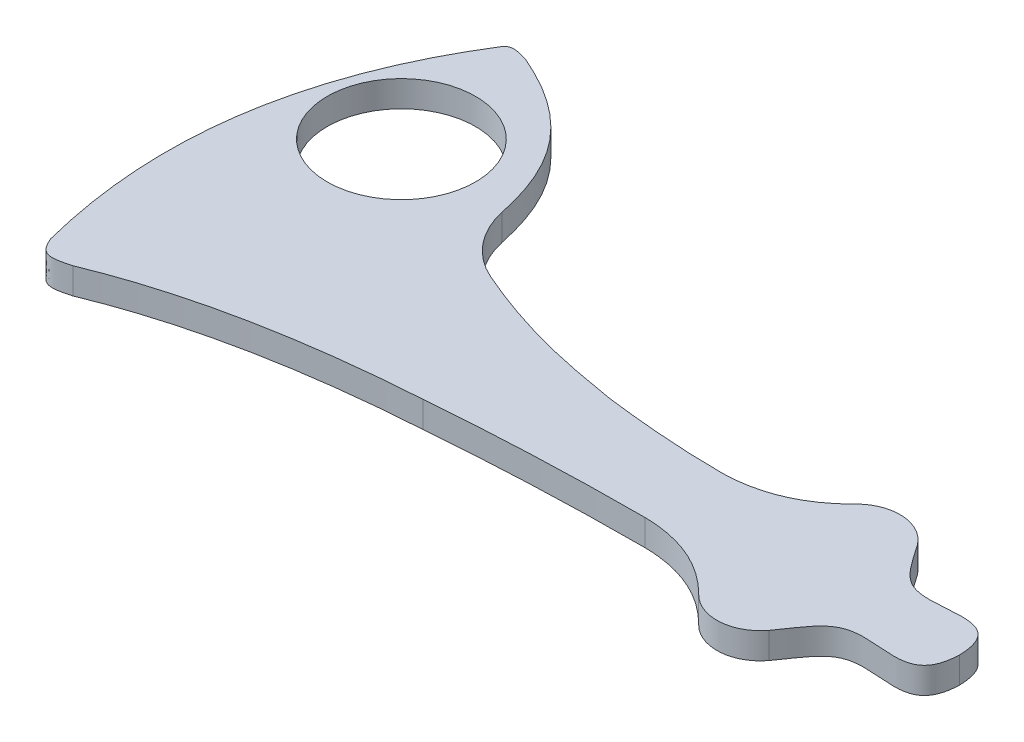
ISO-10303-21;
HEADER;
FILE_DESCRIPTION(('STEP AP214'),'2;1');
FILE_NAME('part.step','',(''),(''),'','','');
FILE_SCHEMA(('AUTOMOTIVE_DESIGN { 1 0 10303 214 1 1 1 1 }'));
ENDSEC;
DATA;
#1=APPLICATION_CONTEXT('core data for automotive mechanical design processes');
#2=APPLICATION_PROTOCOL_DEFINITION('international standard','automotive_design',2000,#1);
#3=PRODUCT_CONTEXT('',#1,'mechanical');
#4=PRODUCT('Part','Part','',(#3));
#5=PRODUCT_RELATED_PRODUCT_CATEGORY('part','',(#4));
#6=PRODUCT_DEFINITION_FORMATION('','',#4);
#7=PRODUCT_DEFINITION_CONTEXT('part definition',#1,'design');
#8=PRODUCT_DEFINITION('design','',#6,#7);
#9=PRODUCT_DEFINITION_SHAPE('','',#8);
#10=(LENGTH_UNIT() NAMED_UNIT(*) SI_UNIT(.MILLI.,.METRE.));
#11=(NAMED_UNIT(*) PLANE_ANGLE_UNIT() SI_UNIT($,.RADIAN.));
#12=(NAMED_UNIT(*) SI_UNIT($,.STERADIAN.) SOLID_ANGLE_UNIT());
#13=UNCERTAINTY_MEASURE_WITH_UNIT(LENGTH_MEASURE(1.E-05),#10,'distance_accuracy_value','');
#14=(GEOMETRIC_REPRESENTATION_CONTEXT(3) GLOBAL_UNCERTAINTY_ASSIGNED_CONTEXT((#13)) GLOBAL_UNIT_ASSIGNED_CONTEXT((#10,
#11,#12)) REPRESENTATION_CONTEXT('',''));
#15=CARTESIAN_POINT('',(0.,0.,0.));
#16=DIRECTION('',(0.,0.,1.));
#17=DIRECTION('',(1.,0.,0.));
#18=AXIS2_PLACEMENT_3D('',#15,#16,#17);
#19=CARTESIAN_POINT('',(-11.6553888811806,3.,-4.41363068161753));
#20=CARTESIAN_POINT('',(-17.9457629966038,3.,-4.41363068161753));
#21=CARTESIAN_POINT('',(-25.5083677659995,3.,-5.38237121889547));
#22=B_SPLINE_CURVE_WITH_KNOTS('',2,(#19,#20,#21),.UNSPECIFIED.,.F.,.F.,(3,3),(0.,1.),.UNSPECIFIED.);
#23=DIRECTION('',(0.,-1.,0.));
#24=VECTOR('',#23,1.);
#25=SURFACE_OF_LINEAR_EXTRUSION('',#22,#24);
#26=CARTESIAN_POINT('',(-11.6553888811806,0.,-4.41363068161753));
#27=CARTESIAN_POINT('',(-17.9457629966038,0.,-4.41363068161753));
#28=CARTESIAN_POINT('',(-25.5083677659995,0.,-5.38237121889547));
#29=B_SPLINE_CURVE_WITH_KNOTS('',2,(#26,#27,#28),.UNSPECIFIED.,.F.,.F.,(3,3),(0.,1.),.UNSPECIFIED.);
#30=CARTESIAN_POINT('',(-11.6553888811812,0.,-4.41363068154062));
#31=VERTEX_POINT('',#30);
#32=CARTESIAN_POINT('',(-25.5083677659995,0.,-5.38237121889547));
#33=VERTEX_POINT('',#32);
#34=EDGE_CURVE('E340',#31,#33,#29,.T.);
#35=ORIENTED_EDGE('',*,*,#34,.T.);
#36=DIRECTION('',(0.,-1.,0.));
#37=VECTOR('',#36,1.);
#38=CARTESIAN_POINT('',(-25.5083677659995,3.,-5.38237121889547));
#39=LINE('',#38,#37);
#40=CARTESIAN_POINT('',(-25.5083677659995,3.,-5.38237121889547));
#41=VERTEX_POINT('',#40);
#42=EDGE_CURVE('E11',#41,#33,#39,.T.);
#43=ORIENTED_EDGE('',*,*,#42,.F.);
#44=CARTESIAN_POINT('',(-11.6553888811812,3.,-4.41363068154062));
#45=VERTEX_POINT('',#44);
#46=EDGE_CURVE('E316',#45,#41,#22,.T.);
#47=ORIENTED_EDGE('',*,*,#46,.F.);
#48=DIRECTION('',(0.,-1.,0.));
#49=VECTOR('',#48,1.);
#50=CARTESIAN_POINT('',(-11.6553888811812,3.,-4.41363068154062));
#51=LINE('',#50,#49);
#52=EDGE_CURVE('E448',#45,#31,#51,.T.);
#53=ORIENTED_EDGE('',*,*,#52,.T.);
#54=EDGE_LOOP('',(#35,#43,#47,#53));
#55=FACE_BOUND('',#54,.T.);
#56=ADVANCED_FACE('F41',(#55),#25,.F.);
#57=CARTESIAN_POINT('',(-25.5083677659995,3.,-5.38237121889547));
#58=CARTESIAN_POINT('',(-31.1461480323899,3.,-6.32659740504326));
#59=CARTESIAN_POINT('',(-36.850904405646,3.,-7.3543490476719));
#60=CARTESIAN_POINT('',(-44.355623999714,3.,-10.6268228263369));
#61=B_SPLINE_CURVE_WITH_KNOTS('',3,(#57,#58,#59,#60),.UNSPECIFIED.,.F.,.F.,(4,4),(0.,1.),.UNSPECIFIED.);
#62=DIRECTION('',(0.,-1.,0.));
#63=VECTOR('',#62,1.);
#64=SURFACE_OF_LINEAR_EXTRUSION('',#61,#63);
#65=CARTESIAN_POINT('',(-25.5083677659995,0.,-5.38237121889547));
#66=CARTESIAN_POINT('',(-31.1461480323899,0.,-6.32659740504326));
#67=CARTESIAN_POINT('',(-36.850904405646,0.,-7.3543490476719));
#68=CARTESIAN_POINT('',(-44.355623999714,0.,-10.6268228263369));
#69=B_SPLINE_CURVE_WITH_KNOTS('',3,(#65,#66,#67,#68),.UNSPECIFIED.,.F.,.F.,(4,4),(0.,1.),.UNSPECIFIED.);
#70=CARTESIAN_POINT('',(-44.355623999714,0.,-10.6268228263369));
#71=VERTEX_POINT('',#70);
#72=EDGE_CURVE('E332',#33,#71,#69,.T.);
#73=ORIENTED_EDGE('',*,*,#72,.T.);
#74=DIRECTION('',(0.,-1.,0.));
#75=VECTOR('',#74,1.);
#76=CARTESIAN_POINT('',(-44.355623999714,3.,-10.6268228263369));
#77=LINE('',#76,#75);
#78=CARTESIAN_POINT('',(-44.355623999714,3.,-10.6268228263369));
#79=VERTEX_POINT('',#78);
#80=EDGE_CURVE('E51',#79,#71,#77,.T.);
#81=ORIENTED_EDGE('',*,*,#80,.F.);
#82=EDGE_CURVE('E119',#41,#79,#61,.T.);
#83=ORIENTED_EDGE('',*,*,#82,.F.);
#84=ORIENTED_EDGE('',*,*,#42,.T.);
#85=EDGE_LOOP('',(#73,#81,#83,#84));
#86=FACE_BOUND('',#85,.T.);
#87=ADVANCED_FACE('F323',(#86),#64,.F.);
#88=CARTESIAN_POINT('',(-40.358552776317,3.,-19.7932518821411));
#89=DIRECTION('',(0.,-1.,0.));
#90=DIRECTION('',(0.,0.,-1.));
#91=AXIS2_PLACEMENT_3D('',#88,#89,#90);
#92=CYLINDRICAL_SURFACE('',#91,10.);
#93=CARTESIAN_POINT('',(-40.358552776317,0.,-19.7932518821411));
#94=DIRECTION('',(0.,1.,0.));
#95=DIRECTION('',(0.,0.,1.));
#96=AXIS2_PLACEMENT_3D('',#93,#94,#95);
#97=CIRCLE('',#96,10.);
#98=CARTESIAN_POINT('',(-50.1420763990057,0.,-17.7237916809551));
#99=VERTEX_POINT('',#98);
#100=EDGE_CURVE('E339',#99,#71,#97,.T.);
#101=ORIENTED_EDGE('',*,*,#100,.F.);
#102=DIRECTION('',(0.,-1.,0.));
#103=VECTOR('',#102,1.);
#104=CARTESIAN_POINT('',(-50.1420763990057,3.,-17.7237916809551));
#105=LINE('',#104,#103);
#106=CARTESIAN_POINT('',(-50.1420763990057,3.,-17.7237916809551));
#107=VERTEX_POINT('',#106);
#108=EDGE_CURVE('E480',#107,#99,#105,.T.);
#109=ORIENTED_EDGE('',*,*,#108,.F.);
#110=CARTESIAN_POINT('',(-40.358552776317,3.,-19.7932518821411));
#111=DIRECTION('',(0.,1.,0.));
#112=DIRECTION('',(0.,0.,1.));
#113=AXIS2_PLACEMENT_3D('',#110,#111,#112);
#114=CIRCLE('',#113,10.);
#115=EDGE_CURVE('E305',#107,#79,#114,.T.);
#116=ORIENTED_EDGE('',*,*,#115,.T.);
#117=ORIENTED_EDGE('',*,*,#80,.T.);
#118=EDGE_LOOP('',(#101,#109,#116,#117));
#119=FACE_BOUND('',#118,.T.);
#120=ADVANCED_FACE('F296',(#119),#92,.F.);
#121=CARTESIAN_POINT('',(-63.9884270555599,3.,-34.2260017558929));
#122=CARTESIAN_POINT('',(-54.9593691532584,3.,-30.3572810300558));
#123=CARTESIAN_POINT('',(-51.6540523549652,3.,-24.8717679858821));
#124=CARTESIAN_POINT('',(-50.1420763990057,3.,-17.7237916809551));
#125=B_SPLINE_CURVE_WITH_KNOTS('',3,(#121,#122,#123,#124),.UNSPECIFIED.,.F.,.F.,(4,4),(0.,1.),.UNSPECIFIED.);
#126=DIRECTION('',(0.,-1.,0.));
#127=VECTOR('',#126,1.);
#128=SURFACE_OF_LINEAR_EXTRUSION('',#125,#127);
#129=CARTESIAN_POINT('',(-63.9884270555599,0.,-34.2260017558929));
#130=CARTESIAN_POINT('',(-54.9593691532584,0.,-30.3572810300558));
#131=CARTESIAN_POINT('',(-51.6540523549652,0.,-24.8717679858821));
#132=CARTESIAN_POINT('',(-50.1420763990057,0.,-17.7237916809551));
#133=B_SPLINE_CURVE_WITH_KNOTS('',3,(#129,#130,#131,#132),.UNSPECIFIED.,.F.,.F.,(4,4),(0.,1.),.UNSPECIFIED.);
#134=CARTESIAN_POINT('',(-63.9884270555599,0.,-34.2260017558929));
#135=VERTEX_POINT('',#134);
#136=EDGE_CURVE('E348',#135,#99,#133,.T.);
#137=ORIENTED_EDGE('',*,*,#136,.F.);
#138=DIRECTION('',(0.,-1.,0.));
#139=VECTOR('',#138,1.);
#140=CARTESIAN_POINT('',(-63.9884270555599,3.,-34.2260017558929));
#141=LINE('',#140,#139);
#142=CARTESIAN_POINT('',(-63.9884270555599,3.,-34.2260017558929));
#143=VERTEX_POINT('',#142);
#144=EDGE_CURVE('E477',#143,#135,#141,.T.);
#145=ORIENTED_EDGE('',*,*,#144,.F.);
#146=EDGE_CURVE('E298',#143,#107,#125,.T.);
#147=ORIENTED_EDGE('',*,*,#146,.T.);
#148=ORIENTED_EDGE('',*,*,#108,.T.);
#149=EDGE_LOOP('',(#137,#145,#147,#148));
#150=FACE_BOUND('',#149,.T.);
#151=ADVANCED_FACE('F292',(#150),#128,.T.);
#152=CARTESIAN_POINT('',(-63.9884270555599,3.,-34.2260017558929));
#153=CARTESIAN_POINT('',(-65.1864275940142,3.,-34.5885014544791));
#154=CARTESIAN_POINT('',(-65.8989726824757,3.,-34.689542599537));
#155=CARTESIAN_POINT('',(-66.2333414218637,3.,-34.5697460352596));
#156=CARTESIAN_POINT('',(-66.5915749351487,3.,-34.1093241901333));
#157=B_SPLINE_CURVE_WITH_KNOTS('',4,(#152,#153,#154,#155,#156),.UNSPECIFIED.,.F.,.F.,(5,5),(0.,
1.),.UNSPECIFIED.);
#158=DIRECTION('',(0.,-1.,0.));
#159=VECTOR('',#158,1.);
#160=SURFACE_OF_LINEAR_EXTRUSION('',#157,#159);
#161=CARTESIAN_POINT('',(-63.9884270555599,0.,-34.2260017558929));
#162=CARTESIAN_POINT('',(-65.1864275940142,0.,-34.5885014544791));
#163=CARTESIAN_POINT('',(-65.8989726824757,0.,-34.689542599537));
#164=CARTESIAN_POINT('',(-66.2333414218637,0.,-34.5697460352596));
#165=CARTESIAN_POINT('',(-66.5915749351487,0.,-34.1093241901333));
#166=B_SPLINE_CURVE_WITH_KNOTS('',4,(#161,#162,#163,#164,#165),.UNSPECIFIED.,.F.,.F.,(5,5),(0.,
1.),.UNSPECIFIED.);
#167=CARTESIAN_POINT('',(-66.5915749351487,0.,-34.1093241901333));
#168=VERTEX_POINT('',#167);
#169=EDGE_CURVE('E352',#135,#168,#166,.T.);
#170=ORIENTED_EDGE('',*,*,#169,.T.);
#171=DIRECTION('',(0.,-1.,0.));
#172=VECTOR('',#171,1.);
#173=CARTESIAN_POINT('',(-66.5915749351487,3.,-34.1093241901333));
#174=LINE('',#173,#172);
#175=CARTESIAN_POINT('',(-66.5915749351487,3.,-34.1093241901333));
#176=VERTEX_POINT('',#175);
#177=EDGE_CURVE('E474',#176,#168,#174,.T.);
#178=ORIENTED_EDGE('',*,*,#177,.F.);
#179=EDGE_CURVE('E277',#143,#176,#157,.T.);
#180=ORIENTED_EDGE('',*,*,#179,.F.);
#181=ORIENTED_EDGE('',*,*,#144,.T.);
#182=EDGE_LOOP('',(#170,#178,#180,#181));
#183=FACE_BOUND('',#182,.T.);
#184=ADVANCED_FACE('F288',(#183),#160,.F.);
#185=CARTESIAN_POINT('',(-73.3546231273215,3.,10.8129430326721));
#186=CARTESIAN_POINT('',(-76.4670650523719,3.,-1.29114493449976));
#187=CARTESIAN_POINT('',(-76.3773709953599,3.,-12.8128854606913));
#188=CARTESIAN_POINT('',(-73.0855409562855,3.,-23.7522785459025));
#189=CARTESIAN_POINT('',(-66.5915749351487,3.,-34.1093241901333));
#190=B_SPLINE_CURVE_WITH_KNOTS('',4,(#185,#186,#187,#188,#189),.UNSPECIFIED.,.F.,.F.,(5,5),(0.,
1.),.UNSPECIFIED.);
#191=DIRECTION('',(0.,-1.,0.));
#192=VECTOR('',#191,1.);
#193=SURFACE_OF_LINEAR_EXTRUSION('',#190,#192);
#194=CARTESIAN_POINT('',(-73.3546231273215,0.,10.8129430326721));
#195=CARTESIAN_POINT('',(-76.4670650523719,0.,-1.29114493449976));
#196=CARTESIAN_POINT('',(-76.3773709953599,0.,-12.8128854606913));
#197=CARTESIAN_POINT('',(-73.0855409562855,0.,-23.7522785459025));
#198=CARTESIAN_POINT('',(-66.5915749351487,0.,-34.1093241901333));
#199=B_SPLINE_CURVE_WITH_KNOTS('',4,(#194,#195,#196,#197,#198),.UNSPECIFIED.,.F.,.F.,(5,5),(0.,
1.),.UNSPECIFIED.);
#200=CARTESIAN_POINT('',(-73.3546231273215,0.,10.8129430326721));
#201=VERTEX_POINT('',#200);
#202=EDGE_CURVE('E367',#201,#168,#199,.T.);
#203=ORIENTED_EDGE('',*,*,#202,.F.);
#204=DIRECTION('',(0.,-1.,0.));
#205=VECTOR('',#204,1.);
#206=CARTESIAN_POINT('',(-73.3546231273215,3.,10.8129430326721));
#207=LINE('',#206,#205);
#208=CARTESIAN_POINT('',(-73.3546231273215,3.,10.8129430326721));
#209=VERTEX_POINT('',#208);
#210=EDGE_CURVE('E471',#209,#201,#207,.T.);
#211=ORIENTED_EDGE('',*,*,#210,.F.);
#212=EDGE_CURVE('E267',#209,#176,#190,.T.);
#213=ORIENTED_EDGE('',*,*,#212,.T.);
#214=ORIENTED_EDGE('',*,*,#177,.T.);
#215=EDGE_LOOP('',(#203,#211,#213,#214));
#216=FACE_BOUND('',#215,.T.);
#217=ADVANCED_FACE('F285',(#216),#193,.T.);
#218=CARTESIAN_POINT('',(-73.3546231273215,3.,10.8129430326721));
#219=CARTESIAN_POINT('',(-72.9201030385127,3.,11.8353511005438));
#220=CARTESIAN_POINT('',(-72.3697802052641,3.,12.6952588636016));
#221=CARTESIAN_POINT('',(-71.7759867436172,3.,12.8885845907973));
#222=CARTESIAN_POINT('',(-69.4037491092399,3.,12.2026234848541));
#223=B_SPLINE_CURVE_WITH_KNOTS('',4,(#218,#219,#220,#221,#222),.UNSPECIFIED.,.F.,.F.,(5,5),(0.,
1.),.UNSPECIFIED.);
#224=DIRECTION('',(0.,-1.,0.));
#225=VECTOR('',#224,1.);
#226=SURFACE_OF_LINEAR_EXTRUSION('',#223,#225);
#227=CARTESIAN_POINT('',(-73.3546231273215,0.,10.8129430326721));
#228=CARTESIAN_POINT('',(-72.9201030385127,0.,11.8353511005438));
#229=CARTESIAN_POINT('',(-72.3697802052641,0.,12.6952588636016));
#230=CARTESIAN_POINT('',(-71.7759867436172,0.,12.8885845907973));
#231=CARTESIAN_POINT('',(-69.4037491092399,0.,12.2026234848541));
#232=B_SPLINE_CURVE_WITH_KNOTS('',4,(#227,#228,#229,#230,#231),.UNSPECIFIED.,.F.,.F.,(5,5),(0.,
1.),.UNSPECIFIED.);
#233=CARTESIAN_POINT('',(-69.4037491092399,0.,12.2026234848541));
#234=VERTEX_POINT('',#233);
#235=EDGE_CURVE('E376',#201,#234,#232,.T.);
#236=ORIENTED_EDGE('',*,*,#235,.T.);
#237=DIRECTION('',(0.,-1.,0.));
#238=VECTOR('',#237,1.);
#239=CARTESIAN_POINT('',(-69.4037491092399,3.,12.2026234848541));
#240=LINE('',#239,#238);
#241=CARTESIAN_POINT('',(-69.4037491092399,3.,12.2026234848541));
#242=VERTEX_POINT('',#241);
#243=EDGE_CURVE('E468',#242,#234,#240,.T.);
#244=ORIENTED_EDGE('',*,*,#243,.F.);
#245=EDGE_CURVE('E258',#209,#242,#223,.T.);
#246=ORIENTED_EDGE('',*,*,#245,.F.);
#247=ORIENTED_EDGE('',*,*,#210,.T.);
#248=EDGE_LOOP('',(#236,#244,#246,#247));
#249=FACE_BOUND('',#248,.T.);
#250=ADVANCED_FACE('F248',(#249),#226,.F.);
#251=CARTESIAN_POINT('',(-36.0963919132068,3.,5.39957970483193));
#252=CARTESIAN_POINT('',(-56.0745331120058,3.,6.69647344989497));
#253=CARTESIAN_POINT('',(-69.4037491092399,3.,12.2026234848541));
#254=B_SPLINE_CURVE_WITH_KNOTS('',2,(#251,#252,#253),.UNSPECIFIED.,.F.,.F.,(3,3),(0.,1.),.UNSPECIFIED.);
#255=DIRECTION('',(0.,-1.,0.));
#256=VECTOR('',#255,1.);
#257=SURFACE_OF_LINEAR_EXTRUSION('',#254,#256);
#258=CARTESIAN_POINT('',(-36.0963919132068,0.,5.39957970483193));
#259=CARTESIAN_POINT('',(-56.0745331120058,0.,6.69647344989497));
#260=CARTESIAN_POINT('',(-69.4037491092399,0.,12.2026234848541));
#261=B_SPLINE_CURVE_WITH_KNOTS('',2,(#258,#259,#260),.UNSPECIFIED.,.F.,.F.,(3,3),(0.,1.),.UNSPECIFIED.);
#262=CARTESIAN_POINT('',(-36.0963919132068,0.,5.39957970483193));
#263=VERTEX_POINT('',#262);
#264=EDGE_CURVE('E385',#263,#234,#261,.T.);
#265=ORIENTED_EDGE('',*,*,#264,.F.);
#266=DIRECTION('',(0.,-1.,0.));
#267=VECTOR('',#266,1.);
#268=CARTESIAN_POINT('',(-36.0963919132068,3.,5.39957970483193));
#269=LINE('',#268,#267);
#270=CARTESIAN_POINT('',(-36.0963919132068,3.,5.39957970483193));
#271=VERTEX_POINT('',#270);
#272=EDGE_CURVE('E465',#271,#263,#269,.T.);
#273=ORIENTED_EDGE('',*,*,#272,.F.);
#274=EDGE_CURVE('E252',#271,#242,#254,.T.);
#275=ORIENTED_EDGE('',*,*,#274,.T.);
#276=ORIENTED_EDGE('',*,*,#243,.T.);
#277=EDGE_LOOP('',(#265,#273,#275,#276));
#278=FACE_BOUND('',#277,.T.);
#279=ADVANCED_FACE('F244',(#278),#257,.T.);
#280=CARTESIAN_POINT('',(-11.6553888811812,3.,4.40645249367121));
#281=CARTESIAN_POINT('',(-24.2073323234029,3.,4.40645249367121));
#282=CARTESIAN_POINT('',(-36.0963919132068,3.,5.39957970483193));
#283=B_SPLINE_CURVE_WITH_KNOTS('',2,(#280,#281,#282),.UNSPECIFIED.,.F.,.F.,(3,3),(0.,1.),.UNSPECIFIED.);
#284=DIRECTION('',(0.,-1.,0.));
#285=VECTOR('',#284,1.);
#286=SURFACE_OF_LINEAR_EXTRUSION('',#283,#285);
#287=CARTESIAN_POINT('',(-11.6553888811812,0.,4.40645249367121));
#288=CARTESIAN_POINT('',(-24.2073323234029,0.,4.40645249367121));
#289=CARTESIAN_POINT('',(-36.0963919132068,0.,5.39957970483193));
#290=B_SPLINE_CURVE_WITH_KNOTS('',2,(#287,#288,#289),.UNSPECIFIED.,.F.,.F.,(3,3),(0.,1.),.UNSPECIFIED.);
#291=CARTESIAN_POINT('',(-11.6553888811812,0.,4.40645249367121));
#292=VERTEX_POINT('',#291);
#293=EDGE_CURVE('E394',#292,#263,#290,.T.);
#294=ORIENTED_EDGE('',*,*,#293,.F.);
#295=DIRECTION('',(0.,-1.,0.));
#296=VECTOR('',#295,1.);
#297=CARTESIAN_POINT('',(-11.6553888811812,3.,4.40645249367121));
#298=LINE('',#297,#296);
#299=CARTESIAN_POINT('',(-11.6553888811812,3.,4.40645249367121));
#300=VERTEX_POINT('',#299);
#301=EDGE_CURVE('E462',#300,#292,#298,.T.);
#302=ORIENTED_EDGE('',*,*,#301,.F.);
#303=EDGE_CURVE('E229',#300,#271,#283,.T.);
#304=ORIENTED_EDGE('',*,*,#303,.T.);
#305=ORIENTED_EDGE('',*,*,#272,.T.);
#306=EDGE_LOOP('',(#294,#302,#304,#305));
#307=FACE_BOUND('',#306,.T.);
#308=ADVANCED_FACE('F240',(#307),#286,.T.);
#309=CARTESIAN_POINT('',(-0.914006815841353,3.,8.99373429221481));
#310=CARTESIAN_POINT('',(-1.91314365676833,3.,7.97405121671478));
#311=CARTESIAN_POINT('',(-5.11360562478819,3.,5.46100604378946));
#312=CARTESIAN_POINT('',(-8.8947109945138,3.,4.44360002017389));
#313=CARTESIAN_POINT('',(-11.6553888811812,3.,4.40645249367121));
#314=B_SPLINE_CURVE_WITH_KNOTS('',3,(#309,#310,#311,#312,#313),.UNSPECIFIED.,.F.,.F.,(4,1,4),
(0.0716661971924701,0.300817676060692,0.740220535039727),.UNSPECIFIED.);
#315=DIRECTION('',(0.,-1.,0.));
#316=VECTOR('',#315,1.);
#317=SURFACE_OF_LINEAR_EXTRUSION('',#314,#316);
#318=CARTESIAN_POINT('',(-0.914006815841353,0.,8.99373429221481));
#319=CARTESIAN_POINT('',(-1.91314365676833,0.,7.97405121671478));
#320=CARTESIAN_POINT('',(-5.11360562478819,0.,5.46100604378946));
#321=CARTESIAN_POINT('',(-8.8947109945138,0.,4.44360002017389));
#322=CARTESIAN_POINT('',(-11.6553888811812,0.,4.40645249367121));
#323=B_SPLINE_CURVE_WITH_KNOTS('',3,(#318,#319,#320,#321,#322),.UNSPECIFIED.,.F.,.F.,(4,1,4),
(0.0716661971924701,0.300817676060692,0.740220535039727),.UNSPECIFIED.);
#324=CARTESIAN_POINT('',(-0.914006815841355,0.,8.99373429221481));
#325=VERTEX_POINT('',#324);
#326=EDGE_CURVE('E403',#325,#292,#323,.T.);
#327=ORIENTED_EDGE('',*,*,#326,.F.);
#328=DIRECTION('',(0.,-1.,0.));
#329=VECTOR('',#328,1.);
#330=CARTESIAN_POINT('',(-0.914006815841355,3.,8.99373429221481));
#331=LINE('',#330,#329);
#332=CARTESIAN_POINT('',(-0.914006815841355,3.,8.99373429221481));
#333=VERTEX_POINT('',#332);
#334=EDGE_CURVE('E459',#333,#325,#331,.T.);
#335=ORIENTED_EDGE('',*,*,#334,.F.);
#336=EDGE_CURVE('E222',#333,#300,#314,.T.);
#337=ORIENTED_EDGE('',*,*,#336,.T.);
#338=ORIENTED_EDGE('',*,*,#301,.T.);
#339=EDGE_LOOP('',(#327,#335,#337,#338));
#340=FACE_BOUND('',#339,.T.);
#341=ADVANCED_FACE('F237',(#340),#317,.T.);
#342=CARTESIAN_POINT('',(2.65732450039914,3.,5.49436397319455));
#343=DIRECTION('',(0.,-1.,0.));
#344=DIRECTION('',(0.,0.,-1.));
#345=AXIS2_PLACEMENT_3D('',#342,#343,#344);
#346=CYLINDRICAL_SURFACE('',#345,5.);
#347=CARTESIAN_POINT('',(2.65732450039914,0.,5.49436397319455));
#348=DIRECTION('',(0.,1.,0.));
#349=DIRECTION('',(0.,0.,1.));
#350=AXIS2_PLACEMENT_3D('',#347,#348,#349);
#351=CIRCLE('',#350,5.);
#352=CARTESIAN_POINT('',(6.64898832150978,0.,8.50544682480066));
#353=VERTEX_POINT('',#352);
#354=EDGE_CURVE('E412',#325,#353,#351,.T.);
#355=ORIENTED_EDGE('',*,*,#354,.T.);
#356=DIRECTION('',(0.,-1.,0.));
#357=VECTOR('',#356,1.);
#358=CARTESIAN_POINT('',(6.64898832150978,3.,8.50544682480066));
#359=LINE('',#358,#357);
#360=CARTESIAN_POINT('',(6.64898832150978,3.,8.50544682480066));
#361=VERTEX_POINT('',#360);
#362=EDGE_CURVE('E455',#361,#353,#359,.T.);
#363=ORIENTED_EDGE('',*,*,#362,.F.);
#364=CARTESIAN_POINT('',(2.65732450039914,3.,5.49436397319455));
#365=DIRECTION('',(0.,1.,0.));
#366=DIRECTION('',(0.,0.,1.));
#367=AXIS2_PLACEMENT_3D('',#364,#365,#366);
#368=CIRCLE('',#367,5.);
#369=EDGE_CURVE('E216',#333,#361,#368,.T.);
#370=ORIENTED_EDGE('',*,*,#369,.F.);
#371=ORIENTED_EDGE('',*,*,#334,.T.);
#372=EDGE_LOOP('',(#355,#363,#370,#371));
#373=FACE_BOUND('',#372,.T.);
#374=ADVANCED_FACE('F208',(#373),#346,.T.);
#375=CARTESIAN_POINT('',(6.64898832150978,3.,8.50544682480066));
#376=CARTESIAN_POINT('',(7.19513647503025,3.,7.78144156396528));
#377=CARTESIAN_POINT('',(8.12564061901088,3.,6.27667634692546));
#378=CARTESIAN_POINT('',(12.2040823246325,3.,1.38355414897938));
#379=CARTESIAN_POINT('',(19.8330875899471,3.,6.55014622851486));
#380=CARTESIAN_POINT('',(20.,3.,0.));
#381=B_SPLINE_CURVE_WITH_KNOTS('',3,(#375,#376,#377,#378,#379,#380),.UNSPECIFIED.,.F.,.F.,(4,1,
1,4),(0.274401368762041,0.379267311129341,0.510399704262783,1.),.UNSPECIFIED.);
#382=DIRECTION('',(0.,-1.,0.));
#383=VECTOR('',#382,1.);
#384=SURFACE_OF_LINEAR_EXTRUSION('',#381,#383);
#385=CARTESIAN_POINT('',(6.64898832150978,0.,8.50544682480066));
#386=CARTESIAN_POINT('',(7.19513647503025,0.,7.78144156396528));
#387=CARTESIAN_POINT('',(8.12564061901088,0.,6.27667634692546));
#388=CARTESIAN_POINT('',(12.2040823246325,0.,1.38355414897938));
#389=CARTESIAN_POINT('',(19.8330875899471,0.,6.55014622851486));
#390=CARTESIAN_POINT('',(20.,0.,0.));
#391=B_SPLINE_CURVE_WITH_KNOTS('',3,(#385,#386,#387,#388,#389,#390),.UNSPECIFIED.,.F.,.F.,(4,1,
1,4),(0.274401368762041,0.379267311129341,0.510399704262783,1.),.UNSPECIFIED.);
#392=CARTESIAN_POINT('',(20.,0.,0.));
#393=VERTEX_POINT('',#392);
#394=EDGE_CURVE('E418',#353,#393,#391,.T.);
#395=ORIENTED_EDGE('',*,*,#394,.T.);
#396=DIRECTION('',(0.,-1.,0.));
#397=VECTOR('',#396,1.);
#398=CARTESIAN_POINT('',(20.,3.,0.));
#399=LINE('',#398,#397);
#400=CARTESIAN_POINT('',(20.,3.,0.));
#401=VERTEX_POINT('',#400);
#402=EDGE_CURVE('E166',#401,#393,#399,.T.);
#403=ORIENTED_EDGE('',*,*,#402,.F.);
#404=EDGE_CURVE('E172',#361,#401,#381,.T.);
#405=ORIENTED_EDGE('',*,*,#404,.F.);
#406=ORIENTED_EDGE('',*,*,#362,.T.);
#407=EDGE_LOOP('',(#395,#403,#405,#406));
#408=FACE_BOUND('',#407,.T.);
#409=ADVANCED_FACE('F205',(#408),#384,.F.);
#410=CARTESIAN_POINT('',(6.64898832150165,3.,-8.50544682481143));
#411=CARTESIAN_POINT('',(7.19513647502546,3.,-7.78144156397298));
#412=CARTESIAN_POINT('',(8.12564061900797,3.,-6.27667634692889));
#413=CARTESIAN_POINT('',(12.2040823246322,3.,-1.38355414897981));
#414=CARTESIAN_POINT('',(19.8330875899472,3.,-6.55014622851469));
#415=CARTESIAN_POINT('',(20.,3.,0.));
#416=B_SPLINE_CURVE_WITH_KNOTS('',3,(#410,#411,#412,#413,#414,#415),.UNSPECIFIED.,.F.,.F.,(4,1,
1,4),(0.274401368761521,0.379267311129373,0.510399704262809,1.),.UNSPECIFIED.);
#417=DIRECTION('',(0.,-1.,0.));
#418=VECTOR('',#417,1.);
#419=SURFACE_OF_LINEAR_EXTRUSION('',#416,#418);
#420=CARTESIAN_POINT('',(6.64898832150165,0.,-8.50544682481143));
#421=CARTESIAN_POINT('',(7.19513647502546,0.,-7.78144156397298));
#422=CARTESIAN_POINT('',(8.12564061900797,0.,-6.27667634692889));
#423=CARTESIAN_POINT('',(12.2040823246322,0.,-1.38355414897981));
#424=CARTESIAN_POINT('',(19.8330875899472,0.,-6.55014622851469));
#425=CARTESIAN_POINT('',(20.,0.,0.));
#426=B_SPLINE_CURVE_WITH_KNOTS('',3,(#420,#421,#422,#423,#424,#425),.UNSPECIFIED.,.F.,.F.,(4,1,
1,4),(0.274401368761521,0.379267311129373,0.510399704262809,1.),.UNSPECIFIED.);
#427=CARTESIAN_POINT('',(6.64898832150165,0.,-8.50544682481143));
#428=VERTEX_POINT('',#427);
#429=EDGE_CURVE('E160',#428,#393,#426,.T.);
#430=ORIENTED_EDGE('',*,*,#429,.F.);
#431=DIRECTION('',(0.,-1.,0.));
#432=VECTOR('',#431,1.);
#433=CARTESIAN_POINT('',(6.64898832150165,3.,-8.50544682481143));
#434=LINE('',#433,#432);
#435=CARTESIAN_POINT('',(6.64898832150165,3.,-8.50544682481143));
#436=VERTEX_POINT('',#435);
#437=EDGE_CURVE('E155',#436,#428,#434,.T.);
#438=ORIENTED_EDGE('',*,*,#437,.F.);
#439=EDGE_CURVE('E158',#436,#401,#416,.T.);
#440=ORIENTED_EDGE('',*,*,#439,.T.);
#441=ORIENTED_EDGE('',*,*,#402,.T.);
#442=EDGE_LOOP('',(#430,#438,#440,#441));
#443=FACE_BOUND('',#442,.T.);
#444=ADVANCED_FACE('F157',(#443),#419,.T.);
#445=CARTESIAN_POINT('',(2.65732450039374,3.,-5.4943639732017));
#446=DIRECTION('',(0.,-1.,0.));
#447=DIRECTION('',(0.,0.,-1.));
#448=AXIS2_PLACEMENT_3D('',#445,#446,#447);
#449=CYLINDRICAL_SURFACE('',#448,5.);
#450=CARTESIAN_POINT('',(2.65732450039374,0.,-5.4943639732017));
#451=DIRECTION('',(0.,1.,0.));
#452=DIRECTION('',(0.,0.,1.));
#453=AXIS2_PLACEMENT_3D('',#450,#451,#452);
#454=CIRCLE('',#453,5.);
#455=CARTESIAN_POINT('',(-0.914006815834625,0.,-8.99373429223433));
#456=VERTEX_POINT('',#455);
#457=EDGE_CURVE('E431',#456,#428,#454,.F.);
#458=ORIENTED_EDGE('',*,*,#457,.F.);
#459=DIRECTION('',(0.,-1.,0.));
#460=VECTOR('',#459,1.);
#461=CARTESIAN_POINT('',(-0.914006815834625,3.,-8.99373429223433));
#462=LINE('',#461,#460);
#463=CARTESIAN_POINT('',(-0.914006815834625,3.,-8.99373429223433));
#464=VERTEX_POINT('',#463);
#465=EDGE_CURVE('E108',#464,#456,#462,.T.);
#466=ORIENTED_EDGE('',*,*,#465,.F.);
#467=CARTESIAN_POINT('',(2.65732450039374,3.,-5.4943639732017));
#468=DIRECTION('',(0.,1.,0.));
#469=DIRECTION('',(0.,0.,1.));
#470=AXIS2_PLACEMENT_3D('',#467,#468,#469);
#471=CIRCLE('',#470,5.);
#472=EDGE_CURVE('E170',#464,#436,#471,.F.);
#473=ORIENTED_EDGE('',*,*,#472,.T.);
#474=ORIENTED_EDGE('',*,*,#437,.T.);
#475=EDGE_LOOP('',(#458,#466,#473,#474));
#476=FACE_BOUND('',#475,.T.);
#477=ADVANCED_FACE('F176',(#476),#449,.T.);
#478=CARTESIAN_POINT('',(-0.914006815834626,3.,-8.99373429223433));
#479=CARTESIAN_POINT('',(-1.92092839368032,3.,-7.96610639461289));
#480=CARTESIAN_POINT('',(-5.07313700843972,3.,-5.48566576349782));
#481=CARTESIAN_POINT('',(-8.88733081749659,3.,-4.45676352037027));
#482=CARTESIAN_POINT('',(-11.6553888811812,3.,-4.41363068154062));
#483=B_SPLINE_CURVE_WITH_KNOTS('',3,(#478,#479,#480,#481,#482),.UNSPECIFIED.,.F.,.F.,(4,1,4),
(0.0716661971918893,0.302603101176995,0.74088404037813),.UNSPECIFIED.);
#484=DIRECTION('',(0.,-1.,0.));
#485=VECTOR('',#484,1.);
#486=SURFACE_OF_LINEAR_EXTRUSION('',#483,#485);
#487=CARTESIAN_POINT('',(-0.914006815834626,0.,-8.99373429223433));
#488=CARTESIAN_POINT('',(-1.92092839368032,0.,-7.96610639461289));
#489=CARTESIAN_POINT('',(-5.07313700843972,0.,-5.48566576349782));
#490=CARTESIAN_POINT('',(-8.88733081749659,0.,-4.45676352037027));
#491=CARTESIAN_POINT('',(-11.6553888811812,0.,-4.41363068154062));
#492=B_SPLINE_CURVE_WITH_KNOTS('',3,(#487,#488,#489,#490,#491),.UNSPECIFIED.,.F.,.F.,(4,1,4),
(0.0716661971918893,0.302603101176995,0.74088404037813),.UNSPECIFIED.);
#493=EDGE_CURVE('E111',#456,#31,#492,.T.);
#494=ORIENTED_EDGE('',*,*,#493,.T.);
#495=ORIENTED_EDGE('',*,*,#52,.F.);
#496=EDGE_CURVE('E59',#464,#45,#483,.T.);
#497=ORIENTED_EDGE('',*,*,#496,.F.);
#498=ORIENTED_EDGE('',*,*,#465,.T.);
#499=EDGE_LOOP('',(#494,#495,#497,#498));
#500=FACE_BOUND('',#499,.T.);
#501=ADVANCED_FACE('F195',(#500),#486,.F.);
#502=CARTESIAN_POINT('',(-63.1522200240699,3.,-19.178037074515));
#503=DIRECTION('',(0.,-1.,0.));
#504=DIRECTION('',(0.,0.,-1.));
#505=AXIS2_PLACEMENT_3D('',#502,#503,#504);
#506=CYLINDRICAL_SURFACE('',#505,8.5);
#507=CARTESIAN_POINT('',(-63.1522200240699,3.,-19.178037074515));
#508=DIRECTION('',(0.,1.,0.));
#509=DIRECTION('',(0.,0.,1.));
#510=AXIS2_PLACEMENT_3D('',#507,#508,#509);
#511=CIRCLE('',#510,8.5);
#512=CARTESIAN_POINT('',(-63.1522200240699,3.,-10.678037074515));
#513=VERTEX_POINT('',#512);
#514=EDGE_CURVE('E180',#513,#513,#511,.T.);
#515=ORIENTED_EDGE('',*,*,#514,.T.);
#516=EDGE_LOOP('',(#515));
#517=FACE_BOUND('',#516,.T.);
#518=CARTESIAN_POINT('',(-63.1522200240699,0.,-19.178037074515));
#519=DIRECTION('',(0.,1.,0.));
#520=DIRECTION('',(0.,0.,1.));
#521=AXIS2_PLACEMENT_3D('',#518,#519,#520);
#522=CIRCLE('',#521,8.5);
#523=CARTESIAN_POINT('',(-63.1522200240699,0.,-10.678037074515));
#524=VERTEX_POINT('',#523);
#525=EDGE_CURVE('E441',#524,#524,#522,.T.);
#526=ORIENTED_EDGE('',*,*,#525,.F.);
#527=EDGE_LOOP('',(#526));
#528=FACE_BOUND('',#527,.T.);
#529=ADVANCED_FACE('F199',(#517,#528),#506,.F.);
#530=CARTESIAN_POINT('',(0.,3.,0.));
#531=DIRECTION('',(0.,1.,0.));
#532=DIRECTION('',(0.,0.,1.));
#533=AXIS2_PLACEMENT_3D('',#530,#531,#532);
#534=PLANE('',#533);
#535=ORIENTED_EDGE('',*,*,#46,.T.);
#536=ORIENTED_EDGE('',*,*,#82,.T.);
#537=ORIENTED_EDGE('',*,*,#115,.F.);
#538=ORIENTED_EDGE('',*,*,#146,.F.);
#539=ORIENTED_EDGE('',*,*,#179,.T.);
#540=ORIENTED_EDGE('',*,*,#212,.F.);
#541=ORIENTED_EDGE('',*,*,#245,.T.);
#542=ORIENTED_EDGE('',*,*,#274,.F.);
#543=ORIENTED_EDGE('',*,*,#303,.F.);
#544=ORIENTED_EDGE('',*,*,#336,.F.);
#545=ORIENTED_EDGE('',*,*,#369,.T.);
#546=ORIENTED_EDGE('',*,*,#404,.T.);
#547=ORIENTED_EDGE('',*,*,#439,.F.);
#548=ORIENTED_EDGE('',*,*,#472,.F.);
#549=ORIENTED_EDGE('',*,*,#496,.T.);
#550=EDGE_LOOP('',(#535,#536,#537,#538,#539,#540,#541,#542,#543,#544,#545,#546,#547,#548,#549));
#551=FACE_BOUND('',#550,.T.);
#552=ORIENTED_EDGE('',*,*,#514,.F.);
#553=EDGE_LOOP('',(#552));
#554=FACE_BOUND('',#553,.T.);
#555=ADVANCED_FACE('F168',(#551,#554),#534,.T.);
#556=CARTESIAN_POINT('',(0.,0.,0.));
#557=DIRECTION('',(0.,1.,0.));
#558=DIRECTION('',(0.,0.,1.));
#559=AXIS2_PLACEMENT_3D('',#556,#557,#558);
#560=PLANE('',#559);
#561=ORIENTED_EDGE('',*,*,#34,.F.);
#562=ORIENTED_EDGE('',*,*,#493,.F.);
#563=ORIENTED_EDGE('',*,*,#457,.T.);
#564=ORIENTED_EDGE('',*,*,#429,.T.);
#565=ORIENTED_EDGE('',*,*,#394,.F.);
#566=ORIENTED_EDGE('',*,*,#354,.F.);
#567=ORIENTED_EDGE('',*,*,#326,.T.);
#568=ORIENTED_EDGE('',*,*,#293,.T.);
#569=ORIENTED_EDGE('',*,*,#264,.T.);
#570=ORIENTED_EDGE('',*,*,#235,.F.);
#571=ORIENTED_EDGE('',*,*,#202,.T.);
#572=ORIENTED_EDGE('',*,*,#169,.F.);
#573=ORIENTED_EDGE('',*,*,#136,.T.);
#574=ORIENTED_EDGE('',*,*,#100,.T.);
#575=ORIENTED_EDGE('',*,*,#72,.F.);
#576=EDGE_LOOP('',(#561,#562,#563,#564,#565,#566,#567,#568,#569,#570,#571,#572,#573,#574,#575));
#577=FACE_BOUND('',#576,.T.);
#578=ORIENTED_EDGE('',*,*,#525,.T.);
#579=EDGE_LOOP('',(#578));
#580=FACE_BOUND('',#579,.T.);
#581=ADVANCED_FACE('F344',(#577,#580),#560,.F.);
#582=CLOSED_SHELL('',(#56,#87,#120,#151,#184,#217,#250,#279,#308,#341,#374,#409,#444,#477,#501,
#529,#555,#581));
#583=MANIFOLD_SOLID_BREP('B2',#582);
#584=ADVANCED_BREP_SHAPE_REPRESENTATION('',(#18,#583),#14);
#585=SHAPE_DEFINITION_REPRESENTATION(#9,#584);
ENDSEC;
END-ISO-10303-21;
